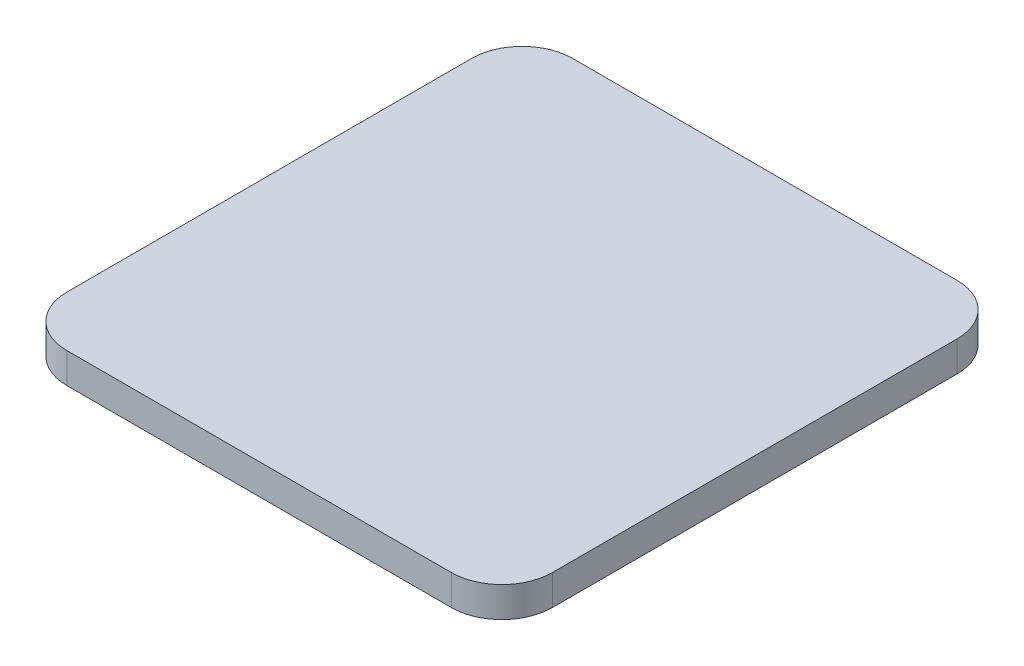
ISO-10303-21;
HEADER;
FILE_DESCRIPTION(('STEP AP214'),'2;1');
FILE_NAME('part.step','',(''),(''),'','','');
FILE_SCHEMA(('AUTOMOTIVE_DESIGN { 1 0 10303 214 1 1 1 1 }'));
ENDSEC;
DATA;
#1=APPLICATION_CONTEXT('core data for automotive mechanical design processes');
#2=APPLICATION_PROTOCOL_DEFINITION('international standard','automotive_design',2000,#1);
#3=PRODUCT_CONTEXT('',#1,'mechanical');
#4=PRODUCT('Part','Part','',(#3));
#5=PRODUCT_RELATED_PRODUCT_CATEGORY('part','',(#4));
#6=PRODUCT_DEFINITION_FORMATION('','',#4);
#7=PRODUCT_DEFINITION_CONTEXT('part definition',#1,'design');
#8=PRODUCT_DEFINITION('design','',#6,#7);
#9=PRODUCT_DEFINITION_SHAPE('','',#8);
#10=(LENGTH_UNIT() NAMED_UNIT(*) SI_UNIT(.MILLI.,.METRE.));
#11=(NAMED_UNIT(*) PLANE_ANGLE_UNIT() SI_UNIT($,.RADIAN.));
#12=(NAMED_UNIT(*) SI_UNIT($,.STERADIAN.) SOLID_ANGLE_UNIT());
#13=UNCERTAINTY_MEASURE_WITH_UNIT(LENGTH_MEASURE(1.E-05),#10,'distance_accuracy_value','');
#14=(GEOMETRIC_REPRESENTATION_CONTEXT(3) GLOBAL_UNCERTAINTY_ASSIGNED_CONTEXT((#13)) GLOBAL_UNIT_ASSIGNED_CONTEXT((#10,
#11,#12)) REPRESENTATION_CONTEXT('',''));
#15=CARTESIAN_POINT('',(0.,0.,0.));
#16=DIRECTION('',(0.,0.,1.));
#17=DIRECTION('',(1.,0.,0.));
#18=AXIS2_PLACEMENT_3D('',#15,#16,#17);
#19=CARTESIAN_POINT('',(13.9215256107525,18.8232894382297,33.2805319551957));
#20=DIRECTION('',(0.,1.,0.));
#21=DIRECTION('',(-1.,0.,0.));
#22=AXIS2_PLACEMENT_3D('',#19,#20,#21);
#23=CYLINDRICAL_SURFACE('',#22,5.);
#24=CARTESIAN_POINT('',(13.9215256107525,21.8232894382297,33.2805319551957));
#25=DIRECTION('',(0.,-1.,0.));
#26=DIRECTION('',(1.,0.,0.));
#27=AXIS2_PLACEMENT_3D('',#24,#25,#26);
#28=CIRCLE('',#27,5.);
#29=CARTESIAN_POINT('',(8.92152561075254,21.8232894382297,33.2805319551957));
#30=VERTEX_POINT('',#29);
#31=CARTESIAN_POINT('',(13.9215256107525,21.8232894382297,28.2805319551957));
#32=VERTEX_POINT('',#31);
#33=EDGE_CURVE('E128',#30,#32,#28,.T.);
#34=ORIENTED_EDGE('',*,*,#33,.T.);
#35=DIRECTION('',(0.,1.,0.));
#36=VECTOR('',#35,1.);
#37=CARTESIAN_POINT('',(13.9215256107525,18.8232894382297,28.2805319551957));
#38=LINE('',#37,#36);
#39=CARTESIAN_POINT('',(13.9215256107525,18.8232894382297,28.2805319551957));
#40=VERTEX_POINT('',#39);
#41=EDGE_CURVE('E11',#40,#32,#38,.T.);
#42=ORIENTED_EDGE('',*,*,#41,.F.);
#43=CARTESIAN_POINT('',(13.9215256107525,18.8232894382297,33.2805319551957));
#44=DIRECTION('',(0.,-1.,0.));
#45=DIRECTION('',(1.,0.,0.));
#46=AXIS2_PLACEMENT_3D('',#43,#44,#45);
#47=CIRCLE('',#46,5.);
#48=CARTESIAN_POINT('',(8.92152561075254,18.8232894382297,33.2805319551957));
#49=VERTEX_POINT('',#48);
#50=EDGE_CURVE('E142',#49,#40,#47,.T.);
#51=ORIENTED_EDGE('',*,*,#50,.F.);
#52=DIRECTION('',(0.,1.,0.));
#53=VECTOR('',#52,1.);
#54=CARTESIAN_POINT('',(8.92152561075254,18.8232894382297,33.2805319551957));
#55=LINE('',#54,#53);
#56=EDGE_CURVE('E124',#49,#30,#55,.T.);
#57=ORIENTED_EDGE('',*,*,#56,.T.);
#58=EDGE_LOOP('',(#34,#42,#51,#57));
#59=FACE_BOUND('',#58,.T.);
#60=ADVANCED_FACE('F32',(#59),#23,.T.);
#61=CARTESIAN_POINT('',(13.9215256107525,18.8232894382297,28.2805319551957));
#62=DIRECTION('',(0.,0.,1.));
#63=DIRECTION('',(1.,0.,0.));
#64=AXIS2_PLACEMENT_3D('',#61,#62,#63);
#65=PLANE('',#64);
#66=DIRECTION('',(1.,0.,0.));
#67=VECTOR('',#66,1.);
#68=CARTESIAN_POINT('',(13.9215256107525,21.8232894382297,28.2805319551957));
#69=LINE('',#68,#67);
#70=CARTESIAN_POINT('',(51.9215256107525,21.8232894382297,28.2805319551957));
#71=VERTEX_POINT('',#70);
#72=EDGE_CURVE('E131',#32,#71,#69,.T.);
#73=ORIENTED_EDGE('',*,*,#72,.T.);
#74=DIRECTION('',(0.,1.,0.));
#75=VECTOR('',#74,1.);
#76=CARTESIAN_POINT('',(51.9215256107525,18.8232894382297,28.2805319551957));
#77=LINE('',#76,#75);
#78=CARTESIAN_POINT('',(51.9215256107525,18.8232894382297,28.2805319551957));
#79=VERTEX_POINT('',#78);
#80=EDGE_CURVE('E40',#79,#71,#77,.T.);
#81=ORIENTED_EDGE('',*,*,#80,.F.);
#82=DIRECTION('',(1.,0.,0.));
#83=VECTOR('',#82,1.);
#84=CARTESIAN_POINT('',(13.9215256107525,18.8232894382297,28.2805319551957));
#85=LINE('',#84,#83);
#86=EDGE_CURVE('E91',#40,#79,#85,.T.);
#87=ORIENTED_EDGE('',*,*,#86,.F.);
#88=ORIENTED_EDGE('',*,*,#41,.T.);
#89=EDGE_LOOP('',(#73,#81,#87,#88));
#90=FACE_BOUND('',#89,.T.);
#91=ADVANCED_FACE('F177',(#90),#65,.F.);
#92=CARTESIAN_POINT('',(51.9215256107525,18.8232894382297,33.2805319551957));
#93=DIRECTION('',(0.,1.,0.));
#94=DIRECTION('',(-1.,0.,0.));
#95=AXIS2_PLACEMENT_3D('',#92,#93,#94);
#96=CYLINDRICAL_SURFACE('',#95,5.);
#97=CARTESIAN_POINT('',(51.9215256107525,21.8232894382297,33.2805319551957));
#98=DIRECTION('',(0.,-1.,0.));
#99=DIRECTION('',(1.,0.,0.));
#100=AXIS2_PLACEMENT_3D('',#97,#98,#99);
#101=CIRCLE('',#100,5.);
#102=CARTESIAN_POINT('',(56.9215256107525,21.8232894382297,33.2805319551957));
#103=VERTEX_POINT('',#102);
#104=EDGE_CURVE('E133',#71,#103,#101,.T.);
#105=ORIENTED_EDGE('',*,*,#104,.T.);
#106=DIRECTION('',(0.,1.,0.));
#107=VECTOR('',#106,1.);
#108=CARTESIAN_POINT('',(56.9215256107525,18.8232894382297,33.2805319551957));
#109=LINE('',#108,#107);
#110=CARTESIAN_POINT('',(56.9215256107525,18.8232894382297,33.2805319551957));
#111=VERTEX_POINT('',#110);
#112=EDGE_CURVE('E149',#111,#103,#109,.T.);
#113=ORIENTED_EDGE('',*,*,#112,.F.);
#114=CARTESIAN_POINT('',(51.9215256107525,18.8232894382297,33.2805319551957));
#115=DIRECTION('',(0.,-1.,0.));
#116=DIRECTION('',(1.,0.,0.));
#117=AXIS2_PLACEMENT_3D('',#114,#115,#116);
#118=CIRCLE('',#117,5.);
#119=EDGE_CURVE('E157',#79,#111,#118,.T.);
#120=ORIENTED_EDGE('',*,*,#119,.F.);
#121=ORIENTED_EDGE('',*,*,#80,.T.);
#122=EDGE_LOOP('',(#105,#113,#120,#121));
#123=FACE_BOUND('',#122,.T.);
#124=ADVANCED_FACE('F155',(#123),#96,.T.);
#125=CARTESIAN_POINT('',(56.9215256107525,18.8232894382297,33.2805319551957));
#126=DIRECTION('',(-1.,0.,0.));
#127=DIRECTION('',(0.,-1.,0.));
#128=AXIS2_PLACEMENT_3D('',#125,#126,#127);
#129=PLANE('',#128);
#130=DIRECTION('',(0.,0.,1.));
#131=VECTOR('',#130,1.);
#132=CARTESIAN_POINT('',(56.9215256107525,21.8232894382297,33.2805319551957));
#133=LINE('',#132,#131);
#134=CARTESIAN_POINT('',(56.9215256107525,21.8232894382297,73.2805319551957));
#135=VERTEX_POINT('',#134);
#136=EDGE_CURVE('E135',#103,#135,#133,.T.);
#137=ORIENTED_EDGE('',*,*,#136,.T.);
#138=DIRECTION('',(0.,1.,0.));
#139=VECTOR('',#138,1.);
#140=CARTESIAN_POINT('',(56.9215256107525,18.8232894382297,73.2805319551957));
#141=LINE('',#140,#139);
#142=CARTESIAN_POINT('',(56.9215256107525,18.8232894382297,73.2805319551957));
#143=VERTEX_POINT('',#142);
#144=EDGE_CURVE('E146',#143,#135,#141,.T.);
#145=ORIENTED_EDGE('',*,*,#144,.F.);
#146=DIRECTION('',(0.,0.,1.));
#147=VECTOR('',#146,1.);
#148=CARTESIAN_POINT('',(56.9215256107525,18.8232894382297,33.2805319551957));
#149=LINE('',#148,#147);
#150=EDGE_CURVE('E169',#111,#143,#149,.T.);
#151=ORIENTED_EDGE('',*,*,#150,.F.);
#152=ORIENTED_EDGE('',*,*,#112,.T.);
#153=EDGE_LOOP('',(#137,#145,#151,#152));
#154=FACE_BOUND('',#153,.T.);
#155=ADVANCED_FACE('F165',(#154),#129,.F.);
#156=CARTESIAN_POINT('',(51.9215256107525,18.8232894382297,73.2805319551957));
#157=DIRECTION('',(0.,1.,0.));
#158=DIRECTION('',(-1.,0.,0.));
#159=AXIS2_PLACEMENT_3D('',#156,#157,#158);
#160=CYLINDRICAL_SURFACE('',#159,5.);
#161=CARTESIAN_POINT('',(51.9215256107525,21.8232894382297,73.2805319551957));
#162=DIRECTION('',(0.,-1.,0.));
#163=DIRECTION('',(1.,0.,0.));
#164=AXIS2_PLACEMENT_3D('',#161,#162,#163);
#165=CIRCLE('',#164,5.);
#166=CARTESIAN_POINT('',(51.9215256107525,21.8232894382297,78.2805319551957));
#167=VERTEX_POINT('',#166);
#168=EDGE_CURVE('E137',#135,#167,#165,.T.);
#169=ORIENTED_EDGE('',*,*,#168,.T.);
#170=DIRECTION('',(0.,1.,0.));
#171=VECTOR('',#170,1.);
#172=CARTESIAN_POINT('',(51.9215256107525,18.8232894382297,78.2805319551957));
#173=LINE('',#172,#171);
#174=CARTESIAN_POINT('',(51.9215256107525,18.8232894382297,78.2805319551957));
#175=VERTEX_POINT('',#174);
#176=EDGE_CURVE('E119',#175,#167,#173,.T.);
#177=ORIENTED_EDGE('',*,*,#176,.F.);
#178=CARTESIAN_POINT('',(51.9215256107525,18.8232894382297,73.2805319551957));
#179=DIRECTION('',(0.,-1.,0.));
#180=DIRECTION('',(1.,0.,0.));
#181=AXIS2_PLACEMENT_3D('',#178,#179,#180);
#182=CIRCLE('',#181,5.);
#183=EDGE_CURVE('E110',#143,#175,#182,.T.);
#184=ORIENTED_EDGE('',*,*,#183,.F.);
#185=ORIENTED_EDGE('',*,*,#144,.T.);
#186=EDGE_LOOP('',(#169,#177,#184,#185));
#187=FACE_BOUND('',#186,.T.);
#188=ADVANCED_FACE('F168',(#187),#160,.T.);
#189=CARTESIAN_POINT('',(51.9215256107525,18.8232894382297,78.2805319551957));
#190=DIRECTION('',(0.,0.,-1.));
#191=DIRECTION('',(-1.,0.,0.));
#192=AXIS2_PLACEMENT_3D('',#189,#190,#191);
#193=PLANE('',#192);
#194=DIRECTION('',(-1.,0.,0.));
#195=VECTOR('',#194,1.);
#196=CARTESIAN_POINT('',(51.9215256107525,21.8232894382297,78.2805319551957));
#197=LINE('',#196,#195);
#198=CARTESIAN_POINT('',(13.9215256107525,21.8232894382297,78.2805319551957));
#199=VERTEX_POINT('',#198);
#200=EDGE_CURVE('E118',#167,#199,#197,.T.);
#201=ORIENTED_EDGE('',*,*,#200,.T.);
#202=DIRECTION('',(0.,1.,0.));
#203=VECTOR('',#202,1.);
#204=CARTESIAN_POINT('',(13.9215256107525,18.8232894382297,78.2805319551957));
#205=LINE('',#204,#203);
#206=CARTESIAN_POINT('',(13.9215256107525,18.8232894382297,78.2805319551957));
#207=VERTEX_POINT('',#206);
#208=EDGE_CURVE('E115',#207,#199,#205,.T.);
#209=ORIENTED_EDGE('',*,*,#208,.F.);
#210=DIRECTION('',(-1.,0.,0.));
#211=VECTOR('',#210,1.);
#212=CARTESIAN_POINT('',(51.9215256107525,18.8232894382297,78.2805319551957));
#213=LINE('',#212,#211);
#214=EDGE_CURVE('E104',#175,#207,#213,.T.);
#215=ORIENTED_EDGE('',*,*,#214,.F.);
#216=ORIENTED_EDGE('',*,*,#176,.T.);
#217=EDGE_LOOP('',(#201,#209,#215,#216));
#218=FACE_BOUND('',#217,.T.);
#219=ADVANCED_FACE('F116',(#218),#193,.F.);
#220=CARTESIAN_POINT('',(13.9215256107525,18.8232894382297,73.2805319551957));
#221=DIRECTION('',(0.,1.,0.));
#222=DIRECTION('',(-1.,0.,0.));
#223=AXIS2_PLACEMENT_3D('',#220,#221,#222);
#224=CYLINDRICAL_SURFACE('',#223,5.);
#225=CARTESIAN_POINT('',(13.9215256107525,21.8232894382297,73.2805319551957));
#226=DIRECTION('',(0.,-1.,0.));
#227=DIRECTION('',(1.,0.,0.));
#228=AXIS2_PLACEMENT_3D('',#225,#226,#227);
#229=CIRCLE('',#228,5.);
#230=CARTESIAN_POINT('',(8.92152561075254,21.8232894382297,73.2805319551956));
#231=VERTEX_POINT('',#230);
#232=EDGE_CURVE('E77',#199,#231,#229,.T.);
#233=ORIENTED_EDGE('',*,*,#232,.T.);
#234=DIRECTION('',(0.,1.,0.));
#235=VECTOR('',#234,1.);
#236=CARTESIAN_POINT('',(8.92152561075254,18.8232894382297,73.2805319551956));
#237=LINE('',#236,#235);
#238=CARTESIAN_POINT('',(8.92152561075254,18.8232894382297,73.2805319551956));
#239=VERTEX_POINT('',#238);
#240=EDGE_CURVE('E120',#239,#231,#237,.T.);
#241=ORIENTED_EDGE('',*,*,#240,.F.);
#242=CARTESIAN_POINT('',(13.9215256107525,18.8232894382297,73.2805319551957));
#243=DIRECTION('',(0.,-1.,0.));
#244=DIRECTION('',(1.,0.,0.));
#245=AXIS2_PLACEMENT_3D('',#242,#243,#244);
#246=CIRCLE('',#245,5.);
#247=EDGE_CURVE('E108',#207,#239,#246,.T.);
#248=ORIENTED_EDGE('',*,*,#247,.F.);
#249=ORIENTED_EDGE('',*,*,#208,.T.);
#250=EDGE_LOOP('',(#233,#241,#248,#249));
#251=FACE_BOUND('',#250,.T.);
#252=ADVANCED_FACE('F122',(#251),#224,.T.);
#253=CARTESIAN_POINT('',(8.92152561075254,18.8232894382297,73.2805319551956));
#254=DIRECTION('',(1.,0.,0.));
#255=DIRECTION('',(0.,1.,0.));
#256=AXIS2_PLACEMENT_3D('',#253,#254,#255);
#257=PLANE('',#256);
#258=DIRECTION('',(0.,0.,-1.));
#259=VECTOR('',#258,1.);
#260=CARTESIAN_POINT('',(8.92152561075254,21.8232894382297,73.2805319551956));
#261=LINE('',#260,#259);
#262=EDGE_CURVE('E83',#231,#30,#261,.T.);
#263=ORIENTED_EDGE('',*,*,#262,.T.);
#264=ORIENTED_EDGE('',*,*,#56,.F.);
#265=DIRECTION('',(0.,0.,-1.));
#266=VECTOR('',#265,1.);
#267=CARTESIAN_POINT('',(8.92152561075254,18.8232894382297,73.2805319551956));
#268=LINE('',#267,#266);
#269=EDGE_CURVE('E48',#239,#49,#268,.T.);
#270=ORIENTED_EDGE('',*,*,#269,.F.);
#271=ORIENTED_EDGE('',*,*,#240,.T.);
#272=EDGE_LOOP('',(#263,#264,#270,#271));
#273=FACE_BOUND('',#272,.T.);
#274=ADVANCED_FACE('F193',(#273),#257,.F.);
#275=CARTESIAN_POINT('',(13.9215256107525,18.8232894382297,33.2805319551957));
#276=DIRECTION('',(0.,-1.,0.));
#277=DIRECTION('',(1.,0.,0.));
#278=AXIS2_PLACEMENT_3D('',#275,#276,#277);
#279=PLANE('',#278);
#280=ORIENTED_EDGE('',*,*,#50,.T.);
#281=ORIENTED_EDGE('',*,*,#86,.T.);
#282=ORIENTED_EDGE('',*,*,#119,.T.);
#283=ORIENTED_EDGE('',*,*,#150,.T.);
#284=ORIENTED_EDGE('',*,*,#183,.T.);
#285=ORIENTED_EDGE('',*,*,#214,.T.);
#286=ORIENTED_EDGE('',*,*,#247,.T.);
#287=ORIENTED_EDGE('',*,*,#269,.T.);
#288=EDGE_LOOP('',(#280,#281,#282,#283,#284,#285,#286,#287));
#289=FACE_BOUND('',#288,.T.);
#290=ADVANCED_FACE('F106',(#289),#279,.T.);
#291=CARTESIAN_POINT('',(13.9215256107525,21.8232894382297,33.2805319551957));
#292=DIRECTION('',(0.,-1.,0.));
#293=DIRECTION('',(1.,0.,0.));
#294=AXIS2_PLACEMENT_3D('',#291,#292,#293);
#295=PLANE('',#294);
#296=ORIENTED_EDGE('',*,*,#33,.F.);
#297=ORIENTED_EDGE('',*,*,#262,.F.);
#298=ORIENTED_EDGE('',*,*,#232,.F.);
#299=ORIENTED_EDGE('',*,*,#200,.F.);
#300=ORIENTED_EDGE('',*,*,#168,.F.);
#301=ORIENTED_EDGE('',*,*,#136,.F.);
#302=ORIENTED_EDGE('',*,*,#104,.F.);
#303=ORIENTED_EDGE('',*,*,#72,.F.);
#304=EDGE_LOOP('',(#296,#297,#298,#299,#300,#301,#302,#303));
#305=FACE_BOUND('',#304,.T.);
#306=ADVANCED_FACE('F161',(#305),#295,.F.);
#307=CLOSED_SHELL('',(#60,#91,#124,#155,#188,#219,#252,#274,#290,#306));
#308=MANIFOLD_SOLID_BREP('B2',#307);
#309=ADVANCED_BREP_SHAPE_REPRESENTATION('',(#18,#308),#14);
#310=SHAPE_DEFINITION_REPRESENTATION(#9,#309);
ENDSEC;
END-ISO-10303-21;
